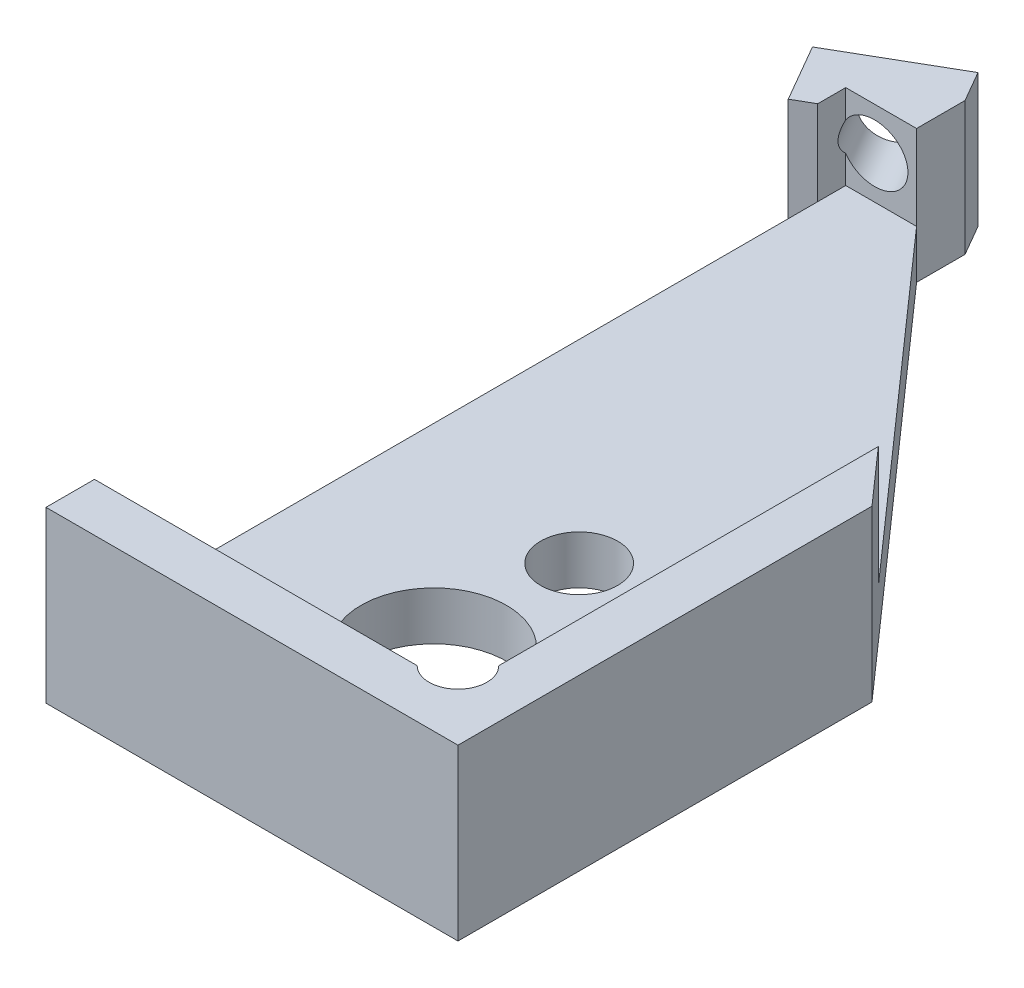
ISO-10303-21;
HEADER;
FILE_DESCRIPTION(('STEP AP214'),'2;1');
FILE_NAME('part.step','',(''),(''),'','','');
FILE_SCHEMA(('AUTOMOTIVE_DESIGN { 1 0 10303 214 1 1 1 1 }'));
ENDSEC;
DATA;
#1=APPLICATION_CONTEXT('core data for automotive mechanical design processes');
#2=APPLICATION_PROTOCOL_DEFINITION('international standard','automotive_design',2000,#1);
#3=PRODUCT_CONTEXT('',#1,'mechanical');
#4=PRODUCT('Part','Part','',(#3));
#5=PRODUCT_RELATED_PRODUCT_CATEGORY('part','',(#4));
#6=PRODUCT_DEFINITION_FORMATION('','',#4);
#7=PRODUCT_DEFINITION_CONTEXT('part definition',#1,'design');
#8=PRODUCT_DEFINITION('design','',#6,#7);
#9=PRODUCT_DEFINITION_SHAPE('','',#8);
#10=(LENGTH_UNIT() NAMED_UNIT(*) SI_UNIT(.MILLI.,.METRE.));
#11=(NAMED_UNIT(*) PLANE_ANGLE_UNIT() SI_UNIT($,.RADIAN.));
#12=(NAMED_UNIT(*) SI_UNIT($,.STERADIAN.) SOLID_ANGLE_UNIT());
#13=UNCERTAINTY_MEASURE_WITH_UNIT(LENGTH_MEASURE(1.E-05),#10,'distance_accuracy_value','');
#14=(GEOMETRIC_REPRESENTATION_CONTEXT(3) GLOBAL_UNCERTAINTY_ASSIGNED_CONTEXT((#13)) GLOBAL_UNIT_ASSIGNED_CONTEXT((#10,
#11,#12)) REPRESENTATION_CONTEXT('',''));
#15=CARTESIAN_POINT('',(0.,0.,0.));
#16=DIRECTION('',(0.,0.,1.));
#17=DIRECTION('',(1.,0.,0.));
#18=AXIS2_PLACEMENT_3D('',#15,#16,#17);
#19=CARTESIAN_POINT('',(0.,3.5,0.));
#20=DIRECTION('',(0.,-1.,0.));
#21=DIRECTION('',(0.,0.,-1.));
#22=AXIS2_PLACEMENT_3D('',#19,#20,#21);
#23=PLANE('',#22);
#24=DIRECTION('',(1.,0.,0.));
#25=VECTOR('',#24,1.);
#26=CARTESIAN_POINT('',(3.25,3.5,7.75));
#27=LINE('',#26,#25);
#28=CARTESIAN_POINT('',(-4.25,3.5,7.75));
#29=VERTEX_POINT('',#28);
#30=CARTESIAN_POINT('',(2.40810098864976,3.5,7.75));
#31=VERTEX_POINT('',#30);
#32=EDGE_CURVE('E304',#29,#31,#27,.T.);
#33=ORIENTED_EDGE('',*,*,#32,.F.);
#34=DIRECTION('',(0.,0.,1.));
#35=VECTOR('',#34,1.);
#36=CARTESIAN_POINT('',(-4.25,3.5,-8.75));
#37=LINE('',#36,#35);
#38=CARTESIAN_POINT('',(-4.25,3.5,8.75));
#39=VERTEX_POINT('',#38);
#40=EDGE_CURVE('E321',#29,#39,#37,.T.);
#41=ORIENTED_EDGE('',*,*,#40,.T.);
#42=DIRECTION('',(1.,0.,0.));
#43=VECTOR('',#42,1.);
#44=CARTESIAN_POINT('',(4.25,3.5,8.75));
#45=LINE('',#44,#43);
#46=CARTESIAN_POINT('',(4.25,3.5,8.75));
#47=VERTEX_POINT('',#46);
#48=EDGE_CURVE('E324',#39,#47,#45,.T.);
#49=ORIENTED_EDGE('',*,*,#48,.T.);
#50=DIRECTION('',(0.,0.,-1.));
#51=VECTOR('',#50,1.);
#52=CARTESIAN_POINT('',(4.25,3.5,-8.75));
#53=LINE('',#52,#51);
#54=CARTESIAN_POINT('',(4.25,3.5,0.208562074203243));
#55=VERTEX_POINT('',#54);
#56=EDGE_CURVE('E328',#47,#55,#53,.T.);
#57=ORIENTED_EDGE('',*,*,#56,.T.);
#58=DIRECTION('',(0.662480336082081,0.,0.749079304416143));
#59=VECTOR('',#58,1.);
#60=CARTESIAN_POINT('',(2.28126017445412,3.5,-2.01753005076142));
#61=LINE('',#60,#59);
#62=CARTESIAN_POINT('',(3.25,3.5,-0.922157229627284));
#63=VERTEX_POINT('',#62);
#64=EDGE_CURVE('E212',#63,#55,#61,.T.);
#65=ORIENTED_EDGE('',*,*,#64,.F.);
#66=DIRECTION('',(0.,0.,-1.));
#67=VECTOR('',#66,1.);
#68=CARTESIAN_POINT('',(3.25,3.5,-7.75));
#69=LINE('',#68,#67);
#70=CARTESIAN_POINT('',(3.25,3.5,6.90810098864977));
#71=VERTEX_POINT('',#70);
#72=EDGE_CURVE('E308',#71,#63,#69,.T.);
#73=ORIENTED_EDGE('',*,*,#72,.F.);
#74=CARTESIAN_POINT('',(2.82905049432488,3.5,7.32905049432488));
#75=DIRECTION('',(0.,1.,0.));
#76=DIRECTION('',(0.,0.,1.));
#77=AXIS2_PLACEMENT_3D('',#74,#75,#76);
#78=CIRCLE('',#77,0.595312500000001);
#79=EDGE_CURVE('E286',#31,#71,#78,.T.);
#80=ORIENTED_EDGE('',*,*,#79,.F.);
#81=EDGE_LOOP('',(#33,#41,#49,#57,#65,#73,#80));
#82=FACE_BOUND('',#81,.T.);
#83=ADVANCED_FACE('F41',(#82),#23,.F.);
#84=CARTESIAN_POINT('',(0.,2.75,0.));
#85=DIRECTION('',(0.,-1.,0.));
#86=DIRECTION('',(0.,0.,-1.));
#87=AXIS2_PLACEMENT_3D('',#84,#85,#86);
#88=PLANE('',#87);
#89=DIRECTION('',(0.,0.,1.));
#90=VECTOR('',#89,1.);
#91=CARTESIAN_POINT('',(-4.25,2.75,0.));
#92=LINE('',#91,#90);
#93=CARTESIAN_POINT('',(-4.25,2.75,-7.75));
#94=VERTEX_POINT('',#93);
#95=CARTESIAN_POINT('',(-4.25,2.75,-7.17264973081037));
#96=VERTEX_POINT('',#95);
#97=EDGE_CURVE('E189',#94,#96,#92,.T.);
#98=ORIENTED_EDGE('',*,*,#97,.F.);
#99=DIRECTION('',(-1.,0.,0.));
#100=VECTOR('',#99,1.);
#101=CARTESIAN_POINT('',(3.25,2.75,-7.75));
#102=LINE('',#101,#100);
#103=CARTESIAN_POINT('',(-2.78849491844891,2.75,-7.75));
#104=VERTEX_POINT('',#103);
#105=EDGE_CURVE('E230',#104,#94,#102,.T.);
#106=ORIENTED_EDGE('',*,*,#105,.F.);
#107=DIRECTION('',(0.,0.,1.));
#108=VECTOR('',#107,1.);
#109=CARTESIAN_POINT('',(-2.78849491844891,2.75,0.));
#110=LINE('',#109,#108);
#111=CARTESIAN_POINT('',(-2.78849491844891,2.75,-8.75));
#112=VERTEX_POINT('',#111);
#113=EDGE_CURVE('E50',#112,#104,#110,.T.);
#114=ORIENTED_EDGE('',*,*,#113,.F.);
#115=DIRECTION('',(-0.499999999999999,0.,-0.866025403784439));
#116=VECTOR('',#115,1.);
#117=CARTESIAN_POINT('',(-3.15387118883668,2.75,-9.38285026419165));
#118=LINE('',#117,#116);
#119=CARTESIAN_POINT('',(-3.15387118883668,2.75,-9.38285026419165));
#120=VERTEX_POINT('',#119);
#121=EDGE_CURVE('E227',#112,#120,#118,.T.);
#122=ORIENTED_EDGE('',*,*,#121,.T.);
#123=DIRECTION('',(-0.866025403784439,0.,0.5));
#124=VECTOR('',#123,1.);
#125=CARTESIAN_POINT('',(-3.15387118883668,2.75,-9.38285026419165));
#126=LINE('',#125,#124);
#127=CARTESIAN_POINT('',(-5.31893469829778,2.75,-8.13285026419165));
#128=VERTEX_POINT('',#127);
#129=EDGE_CURVE('E65',#120,#128,#126,.T.);
#130=ORIENTED_EDGE('',*,*,#129,.T.);
#131=DIRECTION('',(0.500000000000001,0.,0.866025403784438));
#132=VECTOR('',#131,1.);
#133=CARTESIAN_POINT('',(-4.63592199640556,2.75,-6.94983756229943));
#134=LINE('',#133,#132);
#135=CARTESIAN_POINT('',(-4.63592199640556,2.75,-6.94983756229943));
#136=VERTEX_POINT('',#135);
#137=EDGE_CURVE('E352',#128,#136,#134,.T.);
#138=ORIENTED_EDGE('',*,*,#137,.T.);
#139=DIRECTION('',(0.866025403784438,0.,-0.500000000000002));
#140=VECTOR('',#139,1.);
#141=CARTESIAN_POINT('',(-2.47085848694447,2.75,-8.19983756229943));
#142=LINE('',#141,#140);
#143=EDGE_CURVE('E221',#136,#96,#142,.T.);
#144=ORIENTED_EDGE('',*,*,#143,.T.);
#145=EDGE_LOOP('',(#98,#106,#114,#122,#130,#138,#144));
#146=FACE_BOUND('',#145,.T.);
#147=ADVANCED_FACE('F365',(#146),#88,.F.);
#148=CARTESIAN_POINT('',(-4.25,3.5,-8.75));
#149=DIRECTION('',(1.,0.,0.));
#150=DIRECTION('',(0.,0.,-1.));
#151=AXIS2_PLACEMENT_3D('',#148,#149,#150);
#152=PLANE('',#151);
#153=DIRECTION('',(0.,-1.,0.));
#154=VECTOR('',#153,1.);
#155=CARTESIAN_POINT('',(-4.25,4.,7.75));
#156=LINE('',#155,#154);
#157=CARTESIAN_POINT('',(-4.25,1.,7.75));
#158=VERTEX_POINT('',#157);
#159=EDGE_CURVE('E176',#29,#158,#156,.T.);
#160=ORIENTED_EDGE('',*,*,#159,.T.);
#161=DIRECTION('',(0.,0.,1.));
#162=VECTOR('',#161,1.);
#163=CARTESIAN_POINT('',(-4.25,1.,7.75));
#164=LINE('',#163,#162);
#165=CARTESIAN_POINT('',(-4.25,1.,-7.17264973081037));
#166=VERTEX_POINT('',#165);
#167=EDGE_CURVE('E182',#166,#158,#164,.T.);
#168=ORIENTED_EDGE('',*,*,#167,.F.);
#169=DIRECTION('',(0.,-1.,0.));
#170=VECTOR('',#169,1.);
#171=CARTESIAN_POINT('',(-4.25,3.5,-7.17264973081037));
#172=LINE('',#171,#170);
#173=CARTESIAN_POINT('',(-4.25,0.,-7.17264973081037));
#174=VERTEX_POINT('',#173);
#175=EDGE_CURVE('E259',#166,#174,#172,.T.);
#176=ORIENTED_EDGE('',*,*,#175,.T.);
#177=DIRECTION('',(0.,0.,1.));
#178=VECTOR('',#177,1.);
#179=CARTESIAN_POINT('',(-4.25,0.,-8.75));
#180=LINE('',#179,#178);
#181=CARTESIAN_POINT('',(-4.25,0.,8.75));
#182=VERTEX_POINT('',#181);
#183=EDGE_CURVE('E167',#174,#182,#180,.T.);
#184=ORIENTED_EDGE('',*,*,#183,.T.);
#185=DIRECTION('',(0.,-1.,0.));
#186=VECTOR('',#185,1.);
#187=CARTESIAN_POINT('',(-4.25,3.5,8.75));
#188=LINE('',#187,#186);
#189=EDGE_CURVE('E344',#39,#182,#188,.T.);
#190=ORIENTED_EDGE('',*,*,#189,.F.);
#191=ORIENTED_EDGE('',*,*,#40,.F.);
#192=EDGE_LOOP('',(#160,#168,#176,#184,#190,#191));
#193=FACE_BOUND('',#192,.T.);
#194=ADVANCED_FACE('F43',(#193),#152,.F.);
#195=CARTESIAN_POINT('',(-4.23640294356723,1.875,-8.75785026419165));
#196=DIRECTION('',(-0.5,0.,-0.866025403784438));
#197=DIRECTION('',(-0.866025403784439,0.,0.5));
#198=AXIS2_PLACEMENT_3D('',#195,#196,#197);
#199=CYLINDRICAL_SURFACE('',#198,0.595629999999999);
#200=CARTESIAN_POINT('',(-4.23640294356723,1.875,-8.75785026419165));
#201=DIRECTION('',(-0.5,0.,-0.866025403784438));
#202=DIRECTION('',(-0.866025403784439,0.,0.5));
#203=AXIS2_PLACEMENT_3D('',#200,#201,#202);
#204=CIRCLE('',#203,0.595629999999999);
#205=CARTESIAN_POINT('',(-4.75223365482336,1.875,-8.46003526419165));
#206=VERTEX_POINT('',#205);
#207=EDGE_CURVE('E215',#206,#206,#204,.T.);
#208=ORIENTED_EDGE('',*,*,#207,.T.);
#209=EDGE_LOOP('',(#208));
#210=FACE_BOUND('',#209,.T.);
#211=CARTESIAN_POINT('',(-3.65452032223335,1.875,-7.75));
#212=DIRECTION('',(0.,0.,-1.));
#213=DIRECTION('',(-1.,0.,0.));
#214=AXIS2_PLACEMENT_3D('',#211,#212,#213);
#215=ELLIPSE('',#214,0.687774281674832,0.595629999999999);
#216=CARTESIAN_POINT('',(-4.25,2.1730403696233,-7.75));
#217=VERTEX_POINT('',#216);
#218=CARTESIAN_POINT('',(-4.25,1.5769596303767,-7.75));
#219=VERTEX_POINT('',#218);
#220=EDGE_CURVE('E57',#217,#219,#215,.T.);
#221=ORIENTED_EDGE('',*,*,#220,.F.);
#222=CARTESIAN_POINT('',(-4.25,1.875,-8.78140105676658));
#223=DIRECTION('',(1.,0.,0.));
#224=DIRECTION('',(0.,0.,-1.));
#225=AXIS2_PLACEMENT_3D('',#222,#223,#224);
#226=ELLIPSE('',#225,1.19126,0.595629999999999);
#227=EDGE_CURVE('E12',#219,#217,#226,.F.);
#228=ORIENTED_EDGE('',*,*,#227,.F.);
#229=EDGE_LOOP('',(#221,#228));
#230=FACE_BOUND('',#229,.T.);
#231=ADVANCED_FACE('F439',(#210,#230),#199,.F.);
#232=CARTESIAN_POINT('',(4.25,3.5,-8.75));
#233=DIRECTION('',(-1.,0.,0.));
#234=DIRECTION('',(0.,0.,1.));
#235=AXIS2_PLACEMENT_3D('',#232,#233,#234);
#236=PLANE('',#235);
#237=DIRECTION('',(0.,-1.,0.));
#238=VECTOR('',#237,1.);
#239=CARTESIAN_POINT('',(4.25,5.,0.208562074203243));
#240=LINE('',#239,#238);
#241=CARTESIAN_POINT('',(4.25,0.,0.208562074203243));
#242=VERTEX_POINT('',#241);
#243=EDGE_CURVE('E204',#55,#242,#240,.T.);
#244=ORIENTED_EDGE('',*,*,#243,.F.);
#245=ORIENTED_EDGE('',*,*,#56,.F.);
#246=DIRECTION('',(0.,-1.,0.));
#247=VECTOR('',#246,1.);
#248=CARTESIAN_POINT('',(4.25,3.5,8.75));
#249=LINE('',#248,#247);
#250=CARTESIAN_POINT('',(4.25,0.,8.75));
#251=VERTEX_POINT('',#250);
#252=EDGE_CURVE('E332',#47,#251,#249,.T.);
#253=ORIENTED_EDGE('',*,*,#252,.T.);
#254=DIRECTION('',(0.,0.,-1.));
#255=VECTOR('',#254,1.);
#256=CARTESIAN_POINT('',(4.25,0.,-8.75));
#257=LINE('',#256,#255);
#258=EDGE_CURVE('E325',#251,#242,#257,.T.);
#259=ORIENTED_EDGE('',*,*,#258,.T.);
#260=EDGE_LOOP('',(#244,#245,#253,#259));
#261=FACE_BOUND('',#260,.T.);
#262=ADVANCED_FACE('F405',(#261),#236,.F.);
#263=CARTESIAN_POINT('',(0.,0.,0.));
#264=DIRECTION('',(0.,-1.,0.));
#265=DIRECTION('',(0.,0.,-1.));
#266=AXIS2_PLACEMENT_3D('',#263,#264,#265);
#267=PLANE('',#266);
#268=CARTESIAN_POINT('',(1.625,0.,6.5));
#269=DIRECTION('',(0.,1.,0.));
#270=DIRECTION('',(0.,0.,1.));
#271=AXIS2_PLACEMENT_3D('',#268,#269,#270);
#272=CIRCLE('',#271,0.79375);
#273=CARTESIAN_POINT('',(1.625,0.,7.29375));
#274=VERTEX_POINT('',#273);
#275=EDGE_CURVE('E266',#274,#274,#272,.T.);
#276=ORIENTED_EDGE('',*,*,#275,.T.);
#277=EDGE_LOOP('',(#276));
#278=FACE_BOUND('',#277,.T.);
#279=CARTESIAN_POINT('',(-2.125,0.,6.5));
#280=DIRECTION('',(0.,1.,0.));
#281=DIRECTION('',(0.,0.,1.));
#282=AXIS2_PLACEMENT_3D('',#279,#280,#281);
#283=CIRCLE('',#282,0.793750000000001);
#284=CARTESIAN_POINT('',(-2.125,0.,7.29375));
#285=VERTEX_POINT('',#284);
#286=EDGE_CURVE('E274',#285,#285,#283,.T.);
#287=ORIENTED_EDGE('',*,*,#286,.T.);
#288=EDGE_LOOP('',(#287));
#289=FACE_BOUND('',#288,.T.);
#290=CARTESIAN_POINT('',(-0.250000000000001,0.,1.75));
#291=DIRECTION('',(0.,1.,0.));
#292=DIRECTION('',(0.,0.,1.));
#293=AXIS2_PLACEMENT_3D('',#290,#291,#292);
#294=CIRCLE('',#293,0.79375);
#295=CARTESIAN_POINT('',(-0.250000000000001,0.,2.54375));
#296=VERTEX_POINT('',#295);
#297=EDGE_CURVE('E282',#296,#296,#294,.T.);
#298=ORIENTED_EDGE('',*,*,#297,.T.);
#299=EDGE_LOOP('',(#298));
#300=FACE_BOUND('',#299,.T.);
#301=CARTESIAN_POINT('',(-0.25,0.,4.75));
#302=DIRECTION('',(0.,1.,0.));
#303=DIRECTION('',(0.,0.,1.));
#304=AXIS2_PLACEMENT_3D('',#301,#302,#303);
#305=CIRCLE('',#304,1.5);
#306=CARTESIAN_POINT('',(-0.25,0.,6.25));
#307=VERTEX_POINT('',#306);
#308=EDGE_CURVE('E300',#307,#307,#305,.T.);
#309=ORIENTED_EDGE('',*,*,#308,.T.);
#310=EDGE_LOOP('',(#309));
#311=FACE_BOUND('',#310,.T.);
#312=DIRECTION('',(0.,0.,1.));
#313=VECTOR('',#312,1.);
#314=CARTESIAN_POINT('',(-2.78849491844891,0.,-9.31323554731023));
#315=LINE('',#314,#313);
#316=CARTESIAN_POINT('',(-2.78849491844891,0.,-8.75));
#317=VERTEX_POINT('',#316);
#318=CARTESIAN_POINT('',(-2.78849491844891,0.,-7.75));
#319=VERTEX_POINT('',#318);
#320=EDGE_CURVE('E196',#317,#319,#315,.T.);
#321=ORIENTED_EDGE('',*,*,#320,.T.);
#322=DIRECTION('',(0.662480336082081,0.,0.749079304416143));
#323=VECTOR('',#322,1.);
#324=CARTESIAN_POINT('',(-2.78849491844891,0.,-7.75));
#325=LINE('',#324,#323);
#326=EDGE_CURVE('E192',#319,#242,#325,.T.);
#327=ORIENTED_EDGE('',*,*,#326,.T.);
#328=ORIENTED_EDGE('',*,*,#258,.F.);
#329=DIRECTION('',(1.,0.,0.));
#330=VECTOR('',#329,1.);
#331=CARTESIAN_POINT('',(4.25,0.,8.75));
#332=LINE('',#331,#330);
#333=EDGE_CURVE('E335',#182,#251,#332,.T.);
#334=ORIENTED_EDGE('',*,*,#333,.F.);
#335=ORIENTED_EDGE('',*,*,#183,.F.);
#336=DIRECTION('',(0.866025403784438,0.,-0.500000000000002));
#337=VECTOR('',#336,1.);
#338=CARTESIAN_POINT('',(-2.47085848694447,0.,-8.19983756229943));
#339=LINE('',#338,#337);
#340=CARTESIAN_POINT('',(-4.63592199640556,0.,-6.94983756229943));
#341=VERTEX_POINT('',#340);
#342=EDGE_CURVE('E241',#341,#174,#339,.T.);
#343=ORIENTED_EDGE('',*,*,#342,.F.);
#344=DIRECTION('',(0.500000000000001,0.,0.866025403784438));
#345=VECTOR('',#344,1.);
#346=CARTESIAN_POINT('',(-4.63592199640556,0.,-6.94983756229943));
#347=LINE('',#346,#345);
#348=CARTESIAN_POINT('',(-5.31893469829778,0.,-8.13285026419165));
#349=VERTEX_POINT('',#348);
#350=EDGE_CURVE('E246',#349,#341,#347,.T.);
#351=ORIENTED_EDGE('',*,*,#350,.F.);
#352=DIRECTION('',(-0.866025403784439,0.,0.5));
#353=VECTOR('',#352,1.);
#354=CARTESIAN_POINT('',(-3.15387118883668,0.,-9.38285026419165));
#355=LINE('',#354,#353);
#356=CARTESIAN_POINT('',(-3.15387118883668,0.,-9.38285026419165));
#357=VERTEX_POINT('',#356);
#358=EDGE_CURVE('E233',#357,#349,#355,.T.);
#359=ORIENTED_EDGE('',*,*,#358,.F.);
#360=DIRECTION('',(-0.499999999999999,0.,-0.866025403784439));
#361=VECTOR('',#360,1.);
#362=CARTESIAN_POINT('',(-3.15387118883668,0.,-9.38285026419165));
#363=LINE('',#362,#361);
#364=EDGE_CURVE('E237',#317,#357,#363,.T.);
#365=ORIENTED_EDGE('',*,*,#364,.F.);
#366=EDGE_LOOP('',(#321,#327,#328,#334,#335,#343,#351,#359,#365));
#367=FACE_BOUND('',#366,.T.);
#368=ADVANCED_FACE('F379',(#278,#289,#300,#311,#367),#267,.T.);
#369=CARTESIAN_POINT('',(0.,1.,0.));
#370=DIRECTION('',(0.,-1.,0.));
#371=DIRECTION('',(0.,0.,-1.));
#372=AXIS2_PLACEMENT_3D('',#369,#370,#371);
#373=PLANE('',#372);
#374=CARTESIAN_POINT('',(-0.25,1.,4.75));
#375=DIRECTION('',(0.,1.,0.));
#376=DIRECTION('',(0.,0.,1.));
#377=AXIS2_PLACEMENT_3D('',#374,#375,#376);
#378=CIRCLE('',#377,1.5);
#379=CARTESIAN_POINT('',(-0.25,1.,6.25));
#380=VERTEX_POINT('',#379);
#381=EDGE_CURVE('E299',#380,#380,#378,.T.);
#382=ORIENTED_EDGE('',*,*,#381,.F.);
#383=EDGE_LOOP('',(#382));
#384=FACE_BOUND('',#383,.T.);
#385=CARTESIAN_POINT('',(-0.250000000000001,1.,1.75));
#386=DIRECTION('',(0.,1.,0.));
#387=DIRECTION('',(0.,0.,1.));
#388=AXIS2_PLACEMENT_3D('',#385,#386,#387);
#389=CIRCLE('',#388,0.79375);
#390=CARTESIAN_POINT('',(-0.250000000000001,1.,2.54375));
#391=VERTEX_POINT('',#390);
#392=EDGE_CURVE('E278',#391,#391,#389,.T.);
#393=ORIENTED_EDGE('',*,*,#392,.F.);
#394=EDGE_LOOP('',(#393));
#395=FACE_BOUND('',#394,.T.);
#396=CARTESIAN_POINT('',(-2.125,1.,6.5));
#397=DIRECTION('',(0.,1.,0.));
#398=DIRECTION('',(0.,0.,1.));
#399=AXIS2_PLACEMENT_3D('',#396,#397,#398);
#400=CIRCLE('',#399,0.793750000000001);
#401=CARTESIAN_POINT('',(-2.125,1.,7.29375));
#402=VERTEX_POINT('',#401);
#403=EDGE_CURVE('E270',#402,#402,#400,.T.);
#404=ORIENTED_EDGE('',*,*,#403,.F.);
#405=EDGE_LOOP('',(#404));
#406=FACE_BOUND('',#405,.T.);
#407=CARTESIAN_POINT('',(1.625,1.,6.5));
#408=DIRECTION('',(0.,1.,0.));
#409=DIRECTION('',(0.,0.,1.));
#410=AXIS2_PLACEMENT_3D('',#407,#408,#409);
#411=CIRCLE('',#410,0.79375);
#412=CARTESIAN_POINT('',(1.625,1.,7.29375));
#413=VERTEX_POINT('',#412);
#414=EDGE_CURVE('E265',#413,#413,#411,.T.);
#415=ORIENTED_EDGE('',*,*,#414,.F.);
#416=EDGE_LOOP('',(#415));
#417=FACE_BOUND('',#416,.T.);
#418=DIRECTION('',(0.662480336082081,0.,0.749079304416143));
#419=VECTOR('',#418,1.);
#420=CARTESIAN_POINT('',(2.28126017445412,1.,-2.01753005076142));
#421=LINE('',#420,#419);
#422=CARTESIAN_POINT('',(-2.78849491844891,1.,-7.75));
#423=VERTEX_POINT('',#422);
#424=CARTESIAN_POINT('',(3.25,1.,-0.922157229627284));
#425=VERTEX_POINT('',#424);
#426=EDGE_CURVE('E164',#423,#425,#421,.T.);
#427=ORIENTED_EDGE('',*,*,#426,.F.);
#428=DIRECTION('',(-1.,0.,0.));
#429=VECTOR('',#428,1.);
#430=CARTESIAN_POINT('',(3.25,1.,-7.75));
#431=LINE('',#430,#429);
#432=CARTESIAN_POINT('',(-4.25,1.,-7.75));
#433=VERTEX_POINT('',#432);
#434=EDGE_CURVE('E157',#423,#433,#431,.T.);
#435=ORIENTED_EDGE('',*,*,#434,.T.);
#436=EDGE_CURVE('E161',#433,#166,#164,.T.);
#437=ORIENTED_EDGE('',*,*,#436,.T.);
#438=ORIENTED_EDGE('',*,*,#167,.T.);
#439=DIRECTION('',(1.,0.,0.));
#440=VECTOR('',#439,1.);
#441=CARTESIAN_POINT('',(3.25,1.,7.75));
#442=LINE('',#441,#440);
#443=CARTESIAN_POINT('',(2.40810098864976,1.,7.75));
#444=VERTEX_POINT('',#443);
#445=EDGE_CURVE('E312',#158,#444,#442,.T.);
#446=ORIENTED_EDGE('',*,*,#445,.T.);
#447=CARTESIAN_POINT('',(2.82905049432488,1.,7.32905049432488));
#448=DIRECTION('',(0.,-1.,0.));
#449=DIRECTION('',(0.,0.,-1.));
#450=AXIS2_PLACEMENT_3D('',#447,#448,#449);
#451=CIRCLE('',#450,0.595312500000001);
#452=CARTESIAN_POINT('',(3.25,1.,6.90810098864977));
#453=VERTEX_POINT('',#452);
#454=EDGE_CURVE('E292',#444,#453,#451,.F.);
#455=ORIENTED_EDGE('',*,*,#454,.T.);
#456=DIRECTION('',(0.,0.,-1.));
#457=VECTOR('',#456,1.);
#458=CARTESIAN_POINT('',(3.25,1.,-7.75));
#459=LINE('',#458,#457);
#460=EDGE_CURVE('E168',#453,#425,#459,.T.);
#461=ORIENTED_EDGE('',*,*,#460,.T.);
#462=EDGE_LOOP('',(#427,#435,#437,#438,#446,#455,#461));
#463=FACE_BOUND('',#462,.T.);
#464=ADVANCED_FACE('F158',(#384,#395,#406,#417,#463),#373,.F.);
#465=CARTESIAN_POINT('',(3.25,-16.8077363139716,-7.75));
#466=DIRECTION('',(1.,0.,0.));
#467=DIRECTION('',(0.,0.,-1.));
#468=AXIS2_PLACEMENT_3D('',#465,#466,#467);
#469=PLANE('',#468);
#470=DIRECTION('',(0.,1.,0.));
#471=VECTOR('',#470,1.);
#472=CARTESIAN_POINT('',(3.25,-16.8077363139716,-0.922157229627284));
#473=LINE('',#472,#471);
#474=EDGE_CURVE('E207',#425,#63,#473,.T.);
#475=ORIENTED_EDGE('',*,*,#474,.F.);
#476=ORIENTED_EDGE('',*,*,#460,.F.);
#477=DIRECTION('',(0.,1.,0.));
#478=VECTOR('',#477,1.);
#479=CARTESIAN_POINT('',(3.25,-0.683798022700471,6.90810098864977));
#480=LINE('',#479,#478);
#481=EDGE_CURVE('E348',#453,#71,#480,.T.);
#482=ORIENTED_EDGE('',*,*,#481,.T.);
#483=ORIENTED_EDGE('',*,*,#72,.T.);
#484=EDGE_LOOP('',(#475,#476,#482,#483));
#485=FACE_BOUND('',#484,.T.);
#486=ADVANCED_FACE('F398',(#485),#469,.F.);
#487=CARTESIAN_POINT('',(3.25,-16.8077363139716,-7.75));
#488=DIRECTION('',(0.,0.,-1.));
#489=DIRECTION('',(-1.,0.,0.));
#490=AXIS2_PLACEMENT_3D('',#487,#488,#489);
#491=PLANE('',#490);
#492=DIRECTION('',(0.,-1.,0.));
#493=VECTOR('',#492,1.);
#494=CARTESIAN_POINT('',(-2.78849491844891,5.,-7.75));
#495=LINE('',#494,#493);
#496=EDGE_CURVE('E203',#104,#423,#495,.T.);
#497=ORIENTED_EDGE('',*,*,#496,.F.);
#498=ORIENTED_EDGE('',*,*,#105,.T.);
#499=DIRECTION('',(0.,-1.,0.));
#500=VECTOR('',#499,1.);
#501=CARTESIAN_POINT('',(-4.25,4.,-7.75));
#502=LINE('',#501,#500);
#503=EDGE_CURVE('E175',#94,#217,#502,.T.);
#504=ORIENTED_EDGE('',*,*,#503,.T.);
#505=ORIENTED_EDGE('',*,*,#220,.T.);
#506=EDGE_CURVE('E170',#219,#433,#502,.T.);
#507=ORIENTED_EDGE('',*,*,#506,.T.);
#508=ORIENTED_EDGE('',*,*,#434,.F.);
#509=EDGE_LOOP('',(#497,#498,#504,#505,#507,#508));
#510=FACE_BOUND('',#509,.T.);
#511=ADVANCED_FACE('F171',(#510),#491,.F.);
#512=CARTESIAN_POINT('',(4.25,3.5,8.75));
#513=DIRECTION('',(0.,0.,-1.));
#514=DIRECTION('',(-1.,0.,0.));
#515=AXIS2_PLACEMENT_3D('',#512,#513,#514);
#516=PLANE('',#515);
#517=ORIENTED_EDGE('',*,*,#333,.T.);
#518=ORIENTED_EDGE('',*,*,#252,.F.);
#519=ORIENTED_EDGE('',*,*,#48,.F.);
#520=ORIENTED_EDGE('',*,*,#189,.T.);
#521=EDGE_LOOP('',(#517,#518,#519,#520));
#522=FACE_BOUND('',#521,.T.);
#523=ADVANCED_FACE('F384',(#522),#516,.F.);
#524=CARTESIAN_POINT('',(3.25,-16.8077363139716,7.75));
#525=DIRECTION('',(0.,0.,1.));
#526=DIRECTION('',(1.,0.,0.));
#527=AXIS2_PLACEMENT_3D('',#524,#525,#526);
#528=PLANE('',#527);
#529=ORIENTED_EDGE('',*,*,#32,.T.);
#530=DIRECTION('',(0.,1.,0.));
#531=VECTOR('',#530,1.);
#532=CARTESIAN_POINT('',(2.40810098864976,-0.683798022700471,7.75));
#533=LINE('',#532,#531);
#534=EDGE_CURVE('E295',#31,#444,#533,.F.);
#535=ORIENTED_EDGE('',*,*,#534,.T.);
#536=ORIENTED_EDGE('',*,*,#445,.F.);
#537=ORIENTED_EDGE('',*,*,#159,.F.);
#538=EDGE_LOOP('',(#529,#535,#536,#537));
#539=FACE_BOUND('',#538,.T.);
#540=ADVANCED_FACE('F391',(#539),#528,.F.);
#541=CARTESIAN_POINT('',(-0.25,0.,4.75));
#542=DIRECTION('',(0.,1.,0.));
#543=DIRECTION('',(0.,0.,1.));
#544=AXIS2_PLACEMENT_3D('',#541,#542,#543);
#545=CYLINDRICAL_SURFACE('',#544,1.5);
#546=ORIENTED_EDGE('',*,*,#308,.F.);
#547=EDGE_LOOP('',(#546));
#548=FACE_BOUND('',#547,.T.);
#549=ORIENTED_EDGE('',*,*,#381,.T.);
#550=EDGE_LOOP('',(#549));
#551=FACE_BOUND('',#550,.T.);
#552=ADVANCED_FACE('F445',(#548,#551),#545,.F.);
#553=CARTESIAN_POINT('',(2.82905049432488,-0.683798022700471,7.32905049432488));
#554=DIRECTION('',(0.,1.,0.));
#555=DIRECTION('',(0.,0.,1.));
#556=AXIS2_PLACEMENT_3D('',#553,#554,#555);
#557=CYLINDRICAL_SURFACE('',#556,0.595312500000001);
#558=ORIENTED_EDGE('',*,*,#79,.T.);
#559=ORIENTED_EDGE('',*,*,#481,.F.);
#560=ORIENTED_EDGE('',*,*,#454,.F.);
#561=ORIENTED_EDGE('',*,*,#534,.F.);
#562=EDGE_LOOP('',(#558,#559,#560,#561));
#563=FACE_BOUND('',#562,.T.);
#564=ADVANCED_FACE('F395',(#563),#557,.F.);
#565=CARTESIAN_POINT('',(-0.250000000000001,0.,1.75));
#566=DIRECTION('',(0.,1.,0.));
#567=DIRECTION('',(0.,0.,1.));
#568=AXIS2_PLACEMENT_3D('',#565,#566,#567);
#569=CYLINDRICAL_SURFACE('',#568,0.79375);
#570=ORIENTED_EDGE('',*,*,#297,.F.);
#571=EDGE_LOOP('',(#570));
#572=FACE_BOUND('',#571,.T.);
#573=ORIENTED_EDGE('',*,*,#392,.T.);
#574=EDGE_LOOP('',(#573));
#575=FACE_BOUND('',#574,.T.);
#576=ADVANCED_FACE('F457',(#572,#575),#569,.F.);
#577=CARTESIAN_POINT('',(-2.125,0.,6.5));
#578=DIRECTION('',(0.,1.,0.));
#579=DIRECTION('',(0.,0.,1.));
#580=AXIS2_PLACEMENT_3D('',#577,#578,#579);
#581=CYLINDRICAL_SURFACE('',#580,0.793750000000001);
#582=ORIENTED_EDGE('',*,*,#286,.F.);
#583=EDGE_LOOP('',(#582));
#584=FACE_BOUND('',#583,.T.);
#585=ORIENTED_EDGE('',*,*,#403,.T.);
#586=EDGE_LOOP('',(#585));
#587=FACE_BOUND('',#586,.T.);
#588=ADVANCED_FACE('F460',(#584,#587),#581,.F.);
#589=CARTESIAN_POINT('',(1.625,0.,6.5));
#590=DIRECTION('',(0.,1.,0.));
#591=DIRECTION('',(0.,0.,1.));
#592=AXIS2_PLACEMENT_3D('',#589,#590,#591);
#593=CYLINDRICAL_SURFACE('',#592,0.79375);
#594=ORIENTED_EDGE('',*,*,#275,.F.);
#595=EDGE_LOOP('',(#594));
#596=FACE_BOUND('',#595,.T.);
#597=ORIENTED_EDGE('',*,*,#414,.T.);
#598=EDGE_LOOP('',(#597));
#599=FACE_BOUND('',#598,.T.);
#600=ADVANCED_FACE('F464',(#596,#599),#593,.F.);
#601=CARTESIAN_POINT('',(-3.15387118883668,-3.74580951374272,-9.38285026419165));
#602=DIRECTION('',(-0.5,0.,-0.866025403784439));
#603=DIRECTION('',(-0.866025403784439,0.,0.5));
#604=AXIS2_PLACEMENT_3D('',#601,#602,#603);
#605=PLANE('',#604);
#606=ORIENTED_EDGE('',*,*,#207,.F.);
#607=EDGE_LOOP('',(#606));
#608=FACE_BOUND('',#607,.T.);
#609=ORIENTED_EDGE('',*,*,#129,.F.);
#610=DIRECTION('',(0.,1.,0.));
#611=VECTOR('',#610,1.);
#612=CARTESIAN_POINT('',(-3.15387118883668,-3.74580951374272,-9.38285026419165));
#613=LINE('',#612,#611);
#614=EDGE_CURVE('E240',#357,#120,#613,.T.);
#615=ORIENTED_EDGE('',*,*,#614,.F.);
#616=ORIENTED_EDGE('',*,*,#358,.T.);
#617=DIRECTION('',(0.,1.,0.));
#618=VECTOR('',#617,1.);
#619=CARTESIAN_POINT('',(-5.31893469829778,-3.74580951374272,-8.13285026419165));
#620=LINE('',#619,#618);
#621=EDGE_CURVE('E236',#349,#128,#620,.T.);
#622=ORIENTED_EDGE('',*,*,#621,.T.);
#623=EDGE_LOOP('',(#609,#615,#616,#622));
#624=FACE_BOUND('',#623,.T.);
#625=ADVANCED_FACE('F413',(#608,#624),#605,.T.);
#626=CARTESIAN_POINT('',(-3.15387118883668,-3.74580951374272,-9.38285026419165));
#627=DIRECTION('',(0.866025403784439,0.,-0.499999999999999));
#628=DIRECTION('',(-0.499999999999999,0.,-0.866025403784439));
#629=AXIS2_PLACEMENT_3D('',#626,#627,#628);
#630=PLANE('',#629);
#631=ORIENTED_EDGE('',*,*,#121,.F.);
#632=DIRECTION('',(0.,1.,0.));
#633=VECTOR('',#632,1.);
#634=CARTESIAN_POINT('',(-2.78849491844891,3.5,-8.75));
#635=LINE('',#634,#633);
#636=EDGE_CURVE('E262',#317,#112,#635,.T.);
#637=ORIENTED_EDGE('',*,*,#636,.F.);
#638=ORIENTED_EDGE('',*,*,#364,.T.);
#639=ORIENTED_EDGE('',*,*,#614,.T.);
#640=EDGE_LOOP('',(#631,#637,#638,#639));
#641=FACE_BOUND('',#640,.T.);
#642=ADVANCED_FACE('F410',(#641),#630,.T.);
#643=CARTESIAN_POINT('',(-2.47085848694447,-3.74580951374272,-8.19983756229943));
#644=DIRECTION('',(0.500000000000002,0.,0.866025403784438));
#645=DIRECTION('',(0.866025403784438,0.,-0.500000000000002));
#646=AXIS2_PLACEMENT_3D('',#643,#644,#645);
#647=PLANE('',#646);
#648=ORIENTED_EDGE('',*,*,#143,.F.);
#649=DIRECTION('',(0.,1.,0.));
#650=VECTOR('',#649,1.);
#651=CARTESIAN_POINT('',(-4.63592199640556,-3.74580951374272,-6.94983756229943));
#652=LINE('',#651,#650);
#653=EDGE_CURVE('E245',#341,#136,#652,.T.);
#654=ORIENTED_EDGE('',*,*,#653,.F.);
#655=ORIENTED_EDGE('',*,*,#342,.T.);
#656=ORIENTED_EDGE('',*,*,#175,.F.);
#657=EDGE_CURVE('E180',#96,#166,#172,.T.);
#658=ORIENTED_EDGE('',*,*,#657,.F.);
#659=EDGE_LOOP('',(#648,#654,#655,#656,#658));
#660=FACE_BOUND('',#659,.T.);
#661=ADVANCED_FACE('F376',(#660),#647,.T.);
#662=CARTESIAN_POINT('',(-4.63592199640556,-3.74580951374272,-6.94983756229943));
#663=DIRECTION('',(-0.866025403784438,0.,0.500000000000001));
#664=DIRECTION('',(0.500000000000001,0.,0.866025403784438));
#665=AXIS2_PLACEMENT_3D('',#662,#663,#664);
#666=PLANE('',#665);
#667=ORIENTED_EDGE('',*,*,#137,.F.);
#668=ORIENTED_EDGE('',*,*,#621,.F.);
#669=ORIENTED_EDGE('',*,*,#350,.T.);
#670=ORIENTED_EDGE('',*,*,#653,.T.);
#671=EDGE_LOOP('',(#667,#668,#669,#670));
#672=FACE_BOUND('',#671,.T.);
#673=ADVANCED_FACE('F416',(#672),#666,.T.);
#674=CARTESIAN_POINT('',(-2.78849491844891,5.,-7.75));
#675=DIRECTION('',(0.749079304416143,0.,-0.662480336082081));
#676=DIRECTION('',(-0.662480336082081,0.,-0.749079304416143));
#677=AXIS2_PLACEMENT_3D('',#674,#675,#676);
#678=PLANE('',#677);
#679=ORIENTED_EDGE('',*,*,#64,.T.);
#680=ORIENTED_EDGE('',*,*,#243,.T.);
#681=ORIENTED_EDGE('',*,*,#326,.F.);
#682=EDGE_CURVE('E200',#423,#319,#495,.T.);
#683=ORIENTED_EDGE('',*,*,#682,.F.);
#684=ORIENTED_EDGE('',*,*,#426,.T.);
#685=ORIENTED_EDGE('',*,*,#474,.T.);
#686=EDGE_LOOP('',(#679,#680,#681,#683,#684,#685));
#687=FACE_BOUND('',#686,.T.);
#688=ADVANCED_FACE('F401',(#687),#678,.T.);
#689=CARTESIAN_POINT('',(-2.78849491844891,5.,-9.31323554731023));
#690=DIRECTION('',(1.,0.,0.));
#691=DIRECTION('',(0.,0.,-1.));
#692=AXIS2_PLACEMENT_3D('',#689,#690,#691);
#693=PLANE('',#692);
#694=ORIENTED_EDGE('',*,*,#113,.T.);
#695=ORIENTED_EDGE('',*,*,#496,.T.);
#696=ORIENTED_EDGE('',*,*,#682,.T.);
#697=ORIENTED_EDGE('',*,*,#320,.F.);
#698=ORIENTED_EDGE('',*,*,#636,.T.);
#699=EDGE_LOOP('',(#694,#695,#696,#697,#698));
#700=FACE_BOUND('',#699,.T.);
#701=ADVANCED_FACE('F358',(#700),#693,.T.);
#702=CARTESIAN_POINT('',(-4.25,4.,7.75));
#703=DIRECTION('',(1.,0.,0.));
#704=DIRECTION('',(0.,0.,-1.));
#705=AXIS2_PLACEMENT_3D('',#702,#703,#704);
#706=PLANE('',#705);
#707=ORIENTED_EDGE('',*,*,#436,.F.);
#708=ORIENTED_EDGE('',*,*,#506,.F.);
#709=ORIENTED_EDGE('',*,*,#227,.T.);
#710=ORIENTED_EDGE('',*,*,#503,.F.);
#711=ORIENTED_EDGE('',*,*,#97,.T.);
#712=ORIENTED_EDGE('',*,*,#657,.T.);
#713=EDGE_LOOP('',(#707,#708,#709,#710,#711,#712));
#714=FACE_BOUND('',#713,.T.);
#715=ADVANCED_FACE('F178',(#714),#706,.T.);
#716=CLOSED_SHELL('',(#83,#147,#194,#231,#262,#368,#464,#486,#511,#523,#540,#552,#564,#576,#588,
#600,#625,#642,#661,#673,#688,#701,#715));
#717=MANIFOLD_SOLID_BREP('B2',#716);
#718=ADVANCED_BREP_SHAPE_REPRESENTATION('',(#18,#717),#14);
#719=SHAPE_DEFINITION_REPRESENTATION(#9,#718);
ENDSEC;
END-ISO-10303-21;
